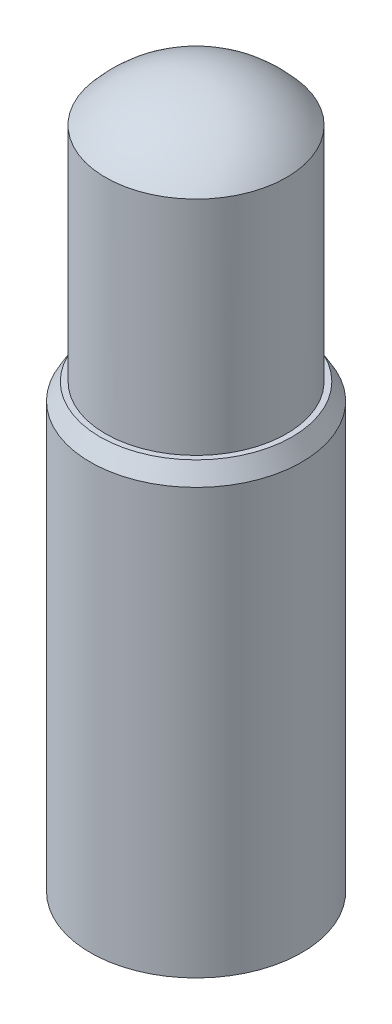
ISO-10303-21;
HEADER;
FILE_DESCRIPTION(('STEP AP214'),'2;1');
FILE_NAME('part.step','',(''),(''),'','','');
FILE_SCHEMA(('AUTOMOTIVE_DESIGN { 1 0 10303 214 1 1 1 1 }'));
ENDSEC;
DATA;
#1=APPLICATION_CONTEXT('core data for automotive mechanical design processes');
#2=APPLICATION_PROTOCOL_DEFINITION('international standard','automotive_design',2000,#1);
#3=PRODUCT_CONTEXT('',#1,'mechanical');
#4=PRODUCT('Part','Part','',(#3));
#5=PRODUCT_RELATED_PRODUCT_CATEGORY('part','',(#4));
#6=PRODUCT_DEFINITION_FORMATION('','',#4);
#7=PRODUCT_DEFINITION_CONTEXT('part definition',#1,'design');
#8=PRODUCT_DEFINITION('design','',#6,#7);
#9=PRODUCT_DEFINITION_SHAPE('','',#8);
#10=(LENGTH_UNIT() NAMED_UNIT(*) SI_UNIT(.MILLI.,.METRE.));
#11=(NAMED_UNIT(*) PLANE_ANGLE_UNIT() SI_UNIT($,.RADIAN.));
#12=(NAMED_UNIT(*) SI_UNIT($,.STERADIAN.) SOLID_ANGLE_UNIT());
#13=UNCERTAINTY_MEASURE_WITH_UNIT(LENGTH_MEASURE(1.E-05),#10,'distance_accuracy_value','');
#14=(GEOMETRIC_REPRESENTATION_CONTEXT(3) GLOBAL_UNCERTAINTY_ASSIGNED_CONTEXT((#13)) GLOBAL_UNIT_ASSIGNED_CONTEXT((#10,
#11,#12)) REPRESENTATION_CONTEXT('',''));
#15=CARTESIAN_POINT('',(0.,0.,0.));
#16=DIRECTION('',(0.,0.,1.));
#17=DIRECTION('',(1.,0.,0.));
#18=AXIS2_PLACEMENT_3D('',#15,#16,#17);
#19=CARTESIAN_POINT('',(1.805,4.04,0.));
#20=DIRECTION('',(0.,-1.,0.));
#21=DIRECTION('',(0.,0.,-1.));
#22=AXIS2_PLACEMENT_3D('',#19,#20,#21);
#23=PLANE('',#22);
#24=CARTESIAN_POINT('',(1.27,4.04,0.));
#25=DIRECTION('',(0.,-1.,0.));
#26=DIRECTION('',(0.,0.,-1.));
#27=AXIS2_PLACEMENT_3D('',#24,#25,#26);
#28=CIRCLE('',#27,0.567264973081037);
#29=CARTESIAN_POINT('',(1.27,4.04,-0.567264973081037));
#30=VERTEX_POINT('',#29);
#31=EDGE_CURVE('E41',#30,#30,#28,.T.);
#32=ORIENTED_EDGE('',*,*,#31,.F.);
#33=EDGE_LOOP('',(#32));
#34=FACE_BOUND('',#33,.T.);
#35=CARTESIAN_POINT('',(1.27,4.04,0.));
#36=DIRECTION('',(0.,-1.,0.));
#37=DIRECTION('',(0.,0.,-1.));
#38=AXIS2_PLACEMENT_3D('',#35,#36,#37);
#39=CIRCLE('',#38,0.535);
#40=CARTESIAN_POINT('',(1.27,4.04,-0.535));
#41=VERTEX_POINT('',#40);
#42=EDGE_CURVE('E10',#41,#41,#39,.T.);
#43=ORIENTED_EDGE('',*,*,#42,.T.);
#44=EDGE_LOOP('',(#43));
#45=FACE_BOUND('',#44,.T.);
#46=ADVANCED_FACE('F14',(#34,#45),#23,.F.);
#47=CARTESIAN_POINT('',(1.27,5.6,0.));
#48=DIRECTION('',(0.,-1.,0.));
#49=DIRECTION('',(0.,0.,-1.));
#50=AXIS2_PLACEMENT_3D('',#47,#48,#49);
#51=CYLINDRICAL_SURFACE('',#50,0.535);
#52=ORIENTED_EDGE('',*,*,#42,.F.);
#53=EDGE_LOOP('',(#52));
#54=FACE_BOUND('',#53,.T.);
#55=CARTESIAN_POINT('',(1.27,5.35141444372107,0.));
#56=DIRECTION('',(0.,-1.,0.));
#57=DIRECTION('',(0.,0.,-1.));
#58=AXIS2_PLACEMENT_3D('',#55,#56,#57);
#59=CIRCLE('',#58,0.535);
#60=CARTESIAN_POINT('',(1.27,5.35141444372107,-0.535));
#61=VERTEX_POINT('',#60);
#62=EDGE_CURVE('E21',#61,#61,#59,.T.);
#63=ORIENTED_EDGE('',*,*,#62,.T.);
#64=EDGE_LOOP('',(#63));
#65=FACE_BOUND('',#64,.T.);
#66=ADVANCED_FACE('F50',(#54,#65),#51,.T.);
#67=CARTESIAN_POINT('',(1.27,4.9,0.));
#68=DIRECTION('',(0.,-1.,0.));
#69=DIRECTION('',(1.,0.,0.));
#70=AXIS2_PLACEMENT_3D('',#67,#68,#69);
#71=SPHERICAL_SURFACE('',#70,0.7);
#72=ORIENTED_EDGE('',*,*,#62,.F.);
#73=EDGE_LOOP('',(#72));
#74=FACE_BOUND('',#73,.T.);
#75=ADVANCED_FACE('F55',(#74),#71,.T.);
#76=CARTESIAN_POINT('',(1.895,1.43,0.));
#77=DIRECTION('',(0.,1.,0.));
#78=DIRECTION('',(0.,0.,1.));
#79=AXIS2_PLACEMENT_3D('',#76,#77,#78);
#80=PLANE('',#79);
#81=CARTESIAN_POINT('',(1.27,1.43,0.));
#82=DIRECTION('',(0.,-1.,0.));
#83=DIRECTION('',(0.,0.,-1.));
#84=AXIS2_PLACEMENT_3D('',#81,#82,#83);
#85=CIRCLE('',#84,0.625);
#86=CARTESIAN_POINT('',(1.27,1.43,-0.625));
#87=VERTEX_POINT('',#86);
#88=EDGE_CURVE('E29',#87,#87,#85,.T.);
#89=ORIENTED_EDGE('',*,*,#88,.T.);
#90=EDGE_LOOP('',(#89));
#91=FACE_BOUND('',#90,.T.);
#92=ADVANCED_FACE('F60',(#91),#80,.F.);
#93=CARTESIAN_POINT('',(1.27,5.6,0.));
#94=DIRECTION('',(0.,-1.,0.));
#95=DIRECTION('',(0.,0.,-1.));
#96=AXIS2_PLACEMENT_3D('',#93,#94,#95);
#97=CYLINDRICAL_SURFACE('',#96,0.625);
#98=ORIENTED_EDGE('',*,*,#88,.F.);
#99=EDGE_LOOP('',(#98));
#100=FACE_BOUND('',#99,.T.);
#101=CARTESIAN_POINT('',(1.27,3.94,0.));
#102=DIRECTION('',(0.,-1.,0.));
#103=DIRECTION('',(0.,0.,-1.));
#104=AXIS2_PLACEMENT_3D('',#101,#102,#103);
#105=CIRCLE('',#104,0.625);
#106=CARTESIAN_POINT('',(1.27,3.94,-0.625));
#107=VERTEX_POINT('',#106);
#108=EDGE_CURVE('E35',#107,#107,#105,.T.);
#109=ORIENTED_EDGE('',*,*,#108,.T.);
#110=EDGE_LOOP('',(#109));
#111=FACE_BOUND('',#110,.T.);
#112=ADVANCED_FACE('F66',(#100,#111),#97,.T.);
#113=CARTESIAN_POINT('',(1.27,4.04,0.));
#114=DIRECTION('',(0.,-1.,0.));
#115=DIRECTION('',(0.,0.,-1.));
#116=AXIS2_PLACEMENT_3D('',#113,#114,#115);
#117=CONICAL_SURFACE('',#116,0.567264973081037,0.523598775598299);
#118=ORIENTED_EDGE('',*,*,#108,.F.);
#119=EDGE_LOOP('',(#118));
#120=FACE_BOUND('',#119,.T.);
#121=ORIENTED_EDGE('',*,*,#31,.T.);
#122=EDGE_LOOP('',(#121));
#123=FACE_BOUND('',#122,.T.);
#124=ADVANCED_FACE('F47',(#120,#123),#117,.T.);
#125=CLOSED_SHELL('',(#46,#66,#75,#92,#112,#124));
#126=MANIFOLD_SOLID_BREP('B1',#125);
#127=ADVANCED_BREP_SHAPE_REPRESENTATION('',(#18,#126),#14);
#128=SHAPE_DEFINITION_REPRESENTATION(#9,#127);
ENDSEC;
END-ISO-10303-21;
